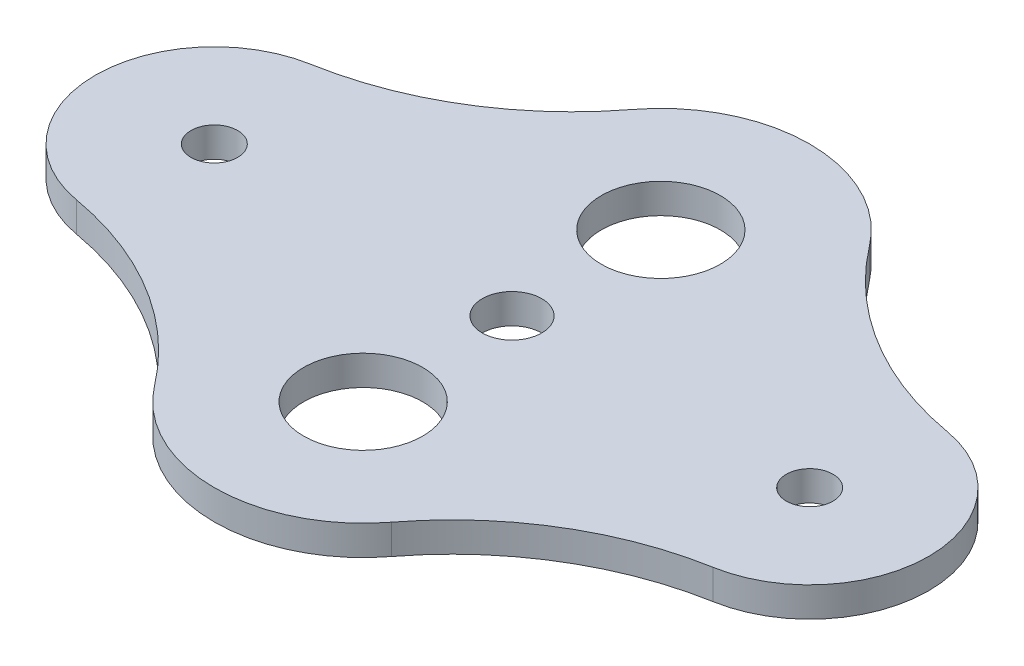
ISO-10303-21;
HEADER;
FILE_DESCRIPTION(('STEP AP214'),'2;1');
FILE_NAME('part.step','',(''),(''),'','','');
FILE_SCHEMA(('AUTOMOTIVE_DESIGN { 1 0 10303 214 1 1 1 1 }'));
ENDSEC;
DATA;
#1=APPLICATION_CONTEXT('core data for automotive mechanical design processes');
#2=APPLICATION_PROTOCOL_DEFINITION('international standard','automotive_design',2000,#1);
#3=PRODUCT_CONTEXT('',#1,'mechanical');
#4=PRODUCT('Part','Part','',(#3));
#5=PRODUCT_RELATED_PRODUCT_CATEGORY('part','',(#4));
#6=PRODUCT_DEFINITION_FORMATION('','',#4);
#7=PRODUCT_DEFINITION_CONTEXT('part definition',#1,'design');
#8=PRODUCT_DEFINITION('design','',#6,#7);
#9=PRODUCT_DEFINITION_SHAPE('','',#8);
#10=(LENGTH_UNIT() NAMED_UNIT(*) SI_UNIT(.MILLI.,.METRE.));
#11=(NAMED_UNIT(*) PLANE_ANGLE_UNIT() SI_UNIT($,.RADIAN.));
#12=(NAMED_UNIT(*) SI_UNIT($,.STERADIAN.) SOLID_ANGLE_UNIT());
#13=UNCERTAINTY_MEASURE_WITH_UNIT(LENGTH_MEASURE(1.E-05),#10,'distance_accuracy_value','');
#14=(GEOMETRIC_REPRESENTATION_CONTEXT(3) GLOBAL_UNCERTAINTY_ASSIGNED_CONTEXT((#13)) GLOBAL_UNIT_ASSIGNED_CONTEXT((#10,
#11,#12)) REPRESENTATION_CONTEXT('',''));
#15=CARTESIAN_POINT('',(0.,0.,0.));
#16=DIRECTION('',(0.,0.,1.));
#17=DIRECTION('',(1.,0.,0.));
#18=AXIS2_PLACEMENT_3D('',#15,#16,#17);
#19=CARTESIAN_POINT('',(-39.9026793061483,3.175,46.2773586122966));
#20=DIRECTION('',(0.,-1.,0.));
#21=DIRECTION('',(0.,0.,-1.));
#22=AXIS2_PLACEMENT_3D('',#19,#20,#21);
#23=CYLINDRICAL_SURFACE('',#22,34.29);
#24=CARTESIAN_POINT('',(-39.9026793061483,0.,46.2773586122966));
#25=DIRECTION('',(0.,-1.,0.));
#26=DIRECTION('',(0.,0.,-1.));
#27=AXIS2_PLACEMENT_3D('',#24,#25,#26);
#28=CIRCLE('',#27,34.29);
#29=CARTESIAN_POINT('',(-33.9534268394995,0.,12.5073942195396));
#30=VERTEX_POINT('',#29);
#31=CARTESIAN_POINT('',(-12.6274301601735,0.,25.4959995608534));
#32=VERTEX_POINT('',#31);
#33=EDGE_CURVE('E129',#30,#32,#28,.T.);
#34=ORIENTED_EDGE('',*,*,#33,.T.);
#35=DIRECTION('',(0.,-1.,0.));
#36=VECTOR('',#35,1.);
#37=CARTESIAN_POINT('',(-12.6274301601735,3.175,25.4959995608534));
#38=LINE('',#37,#36);
#39=CARTESIAN_POINT('',(-12.6274301601735,3.175,25.4959995608534));
#40=VERTEX_POINT('',#39);
#41=EDGE_CURVE('E11',#40,#32,#38,.T.);
#42=ORIENTED_EDGE('',*,*,#41,.F.);
#43=CARTESIAN_POINT('',(-39.9026793061483,3.175,46.2773586122966));
#44=DIRECTION('',(0.,-1.,0.));
#45=DIRECTION('',(0.,0.,-1.));
#46=AXIS2_PLACEMENT_3D('',#43,#44,#45);
#47=CIRCLE('',#46,34.29);
#48=CARTESIAN_POINT('',(-33.9534268394995,3.175,12.5073942195396));
#49=VERTEX_POINT('',#48);
#50=EDGE_CURVE('E144',#49,#40,#47,.T.);
#51=ORIENTED_EDGE('',*,*,#50,.F.);
#52=DIRECTION('',(0.,-1.,0.));
#53=VECTOR('',#52,1.);
#54=CARTESIAN_POINT('',(-33.9534268394995,3.175,12.5073942195396));
#55=LINE('',#54,#53);
#56=EDGE_CURVE('E125',#49,#30,#55,.T.);
#57=ORIENTED_EDGE('',*,*,#56,.T.);
#58=EDGE_LOOP('',(#34,#42,#51,#57));
#59=FACE_BOUND('',#58,.T.);
#60=ADVANCED_FACE('F33',(#59),#23,.F.);
#61=CARTESIAN_POINT('',(0.,3.175,15.875));
#62=DIRECTION('',(0.,-1.,0.));
#63=DIRECTION('',(0.,0.,-1.));
#64=AXIS2_PLACEMENT_3D('',#61,#62,#63);
#65=CYLINDRICAL_SURFACE('',#64,15.875);
#66=CARTESIAN_POINT('',(0.,0.,15.875));
#67=DIRECTION('',(0.,1.,0.));
#68=DIRECTION('',(0.,0.,1.));
#69=AXIS2_PLACEMENT_3D('',#66,#67,#68);
#70=CIRCLE('',#69,15.875);
#71=CARTESIAN_POINT('',(12.6274301601735,0.,25.4959995608534));
#72=VERTEX_POINT('',#71);
#73=EDGE_CURVE('E132',#32,#72,#70,.T.);
#74=ORIENTED_EDGE('',*,*,#73,.T.);
#75=DIRECTION('',(0.,-1.,0.));
#76=VECTOR('',#75,1.);
#77=CARTESIAN_POINT('',(12.6274301601735,3.175,25.4959995608534));
#78=LINE('',#77,#76);
#79=CARTESIAN_POINT('',(12.6274301601735,3.175,25.4959995608534));
#80=VERTEX_POINT('',#79);
#81=EDGE_CURVE('E41',#80,#72,#78,.T.);
#82=ORIENTED_EDGE('',*,*,#81,.F.);
#83=CARTESIAN_POINT('',(0.,3.175,15.875));
#84=DIRECTION('',(0.,1.,0.));
#85=DIRECTION('',(0.,0.,1.));
#86=AXIS2_PLACEMENT_3D('',#83,#84,#85);
#87=CIRCLE('',#86,15.875);
#88=EDGE_CURVE('E92',#40,#80,#87,.T.);
#89=ORIENTED_EDGE('',*,*,#88,.F.);
#90=ORIENTED_EDGE('',*,*,#41,.T.);
#91=EDGE_LOOP('',(#74,#82,#89,#90));
#92=FACE_BOUND('',#91,.T.);
#93=ADVANCED_FACE('F243',(#92),#65,.T.);
#94=CARTESIAN_POINT('',(39.9026793061483,3.175,46.2773586122966));
#95=DIRECTION('',(0.,-1.,0.));
#96=DIRECTION('',(0.,0.,-1.));
#97=AXIS2_PLACEMENT_3D('',#94,#95,#96);
#98=CYLINDRICAL_SURFACE('',#97,34.29);
#99=CARTESIAN_POINT('',(39.9026793061483,0.,46.2773586122966));
#100=DIRECTION('',(0.,-1.,0.));
#101=DIRECTION('',(0.,0.,-1.));
#102=AXIS2_PLACEMENT_3D('',#99,#100,#101);
#103=CIRCLE('',#102,34.29);
#104=CARTESIAN_POINT('',(33.9534268394995,0.,12.5073942195396));
#105=VERTEX_POINT('',#104);
#106=EDGE_CURVE('E135',#72,#105,#103,.T.);
#107=ORIENTED_EDGE('',*,*,#106,.T.);
#108=DIRECTION('',(0.,-1.,0.));
#109=VECTOR('',#108,1.);
#110=CARTESIAN_POINT('',(33.9534268394995,3.175,12.5073942195396));
#111=LINE('',#110,#109);
#112=CARTESIAN_POINT('',(33.9534268394995,3.175,12.5073942195396));
#113=VERTEX_POINT('',#112);
#114=EDGE_CURVE('E151',#113,#105,#111,.T.);
#115=ORIENTED_EDGE('',*,*,#114,.F.);
#116=CARTESIAN_POINT('',(39.9026793061483,3.175,46.2773586122966));
#117=DIRECTION('',(0.,-1.,0.));
#118=DIRECTION('',(0.,0.,-1.));
#119=AXIS2_PLACEMENT_3D('',#116,#117,#118);
#120=CIRCLE('',#119,34.29);
#121=EDGE_CURVE('E159',#80,#113,#120,.T.);
#122=ORIENTED_EDGE('',*,*,#121,.F.);
#123=ORIENTED_EDGE('',*,*,#81,.T.);
#124=EDGE_LOOP('',(#107,#115,#122,#123));
#125=FACE_BOUND('',#124,.T.);
#126=ADVANCED_FACE('F157',(#125),#98,.F.);
#127=CARTESIAN_POINT('',(31.75,3.175,0.));
#128=DIRECTION('',(0.,-1.,0.));
#129=DIRECTION('',(0.,0.,-1.));
#130=AXIS2_PLACEMENT_3D('',#127,#128,#129);
#131=CYLINDRICAL_SURFACE('',#130,12.7);
#132=CARTESIAN_POINT('',(31.75,0.,0.));
#133=DIRECTION('',(0.,1.,0.));
#134=DIRECTION('',(0.,0.,1.));
#135=AXIS2_PLACEMENT_3D('',#132,#133,#134);
#136=CIRCLE('',#135,12.7);
#137=CARTESIAN_POINT('',(33.9534268394995,0.,-12.5073942195396));
#138=VERTEX_POINT('',#137);
#139=EDGE_CURVE('E137',#105,#138,#136,.T.);
#140=ORIENTED_EDGE('',*,*,#139,.T.);
#141=DIRECTION('',(0.,-1.,0.));
#142=VECTOR('',#141,1.);
#143=CARTESIAN_POINT('',(33.9534268394995,3.175,-12.5073942195396));
#144=LINE('',#143,#142);
#145=CARTESIAN_POINT('',(33.9534268394995,3.175,-12.5073942195396));
#146=VERTEX_POINT('',#145);
#147=EDGE_CURVE('E148',#146,#138,#144,.T.);
#148=ORIENTED_EDGE('',*,*,#147,.F.);
#149=CARTESIAN_POINT('',(31.75,3.175,0.));
#150=DIRECTION('',(0.,1.,0.));
#151=DIRECTION('',(0.,0.,1.));
#152=AXIS2_PLACEMENT_3D('',#149,#150,#151);
#153=CIRCLE('',#152,12.7);
#154=EDGE_CURVE('E171',#113,#146,#153,.T.);
#155=ORIENTED_EDGE('',*,*,#154,.F.);
#156=ORIENTED_EDGE('',*,*,#114,.T.);
#157=EDGE_LOOP('',(#140,#148,#155,#156));
#158=FACE_BOUND('',#157,.T.);
#159=ADVANCED_FACE('F167',(#158),#131,.T.);
#160=CARTESIAN_POINT('',(39.9026793061483,3.175,-46.2773586122966));
#161=DIRECTION('',(0.,-1.,0.));
#162=DIRECTION('',(0.,0.,-1.));
#163=AXIS2_PLACEMENT_3D('',#160,#161,#162);
#164=CYLINDRICAL_SURFACE('',#163,34.29);
#165=CARTESIAN_POINT('',(39.9026793061483,0.,-46.2773586122966));
#166=DIRECTION('',(0.,-1.,0.));
#167=DIRECTION('',(0.,0.,1.));
#168=AXIS2_PLACEMENT_3D('',#165,#166,#167);
#169=CIRCLE('',#168,34.29);
#170=CARTESIAN_POINT('',(12.6274301601735,0.,-25.4959995608534));
#171=VERTEX_POINT('',#170);
#172=EDGE_CURVE('E139',#138,#171,#169,.T.);
#173=ORIENTED_EDGE('',*,*,#172,.T.);
#174=DIRECTION('',(0.,-1.,0.));
#175=VECTOR('',#174,1.);
#176=CARTESIAN_POINT('',(12.6274301601735,3.175,-25.4959995608534));
#177=LINE('',#176,#175);
#178=CARTESIAN_POINT('',(12.6274301601735,3.175,-25.4959995608534));
#179=VERTEX_POINT('',#178);
#180=EDGE_CURVE('E120',#179,#171,#177,.T.);
#181=ORIENTED_EDGE('',*,*,#180,.F.);
#182=CARTESIAN_POINT('',(39.9026793061483,3.175,-46.2773586122966));
#183=DIRECTION('',(0.,-1.,0.));
#184=DIRECTION('',(0.,0.,1.));
#185=AXIS2_PLACEMENT_3D('',#182,#183,#184);
#186=CIRCLE('',#185,34.29);
#187=EDGE_CURVE('E111',#146,#179,#186,.T.);
#188=ORIENTED_EDGE('',*,*,#187,.F.);
#189=ORIENTED_EDGE('',*,*,#147,.T.);
#190=EDGE_LOOP('',(#173,#181,#188,#189));
#191=FACE_BOUND('',#190,.T.);
#192=ADVANCED_FACE('F170',(#191),#164,.F.);
#193=CARTESIAN_POINT('',(0.,3.175,-15.875));
#194=DIRECTION('',(0.,-1.,0.));
#195=DIRECTION('',(0.,0.,-1.));
#196=AXIS2_PLACEMENT_3D('',#193,#194,#195);
#197=CYLINDRICAL_SURFACE('',#196,15.875);
#198=CARTESIAN_POINT('',(0.,0.,-15.875));
#199=DIRECTION('',(0.,1.,0.));
#200=DIRECTION('',(0.,0.,1.));
#201=AXIS2_PLACEMENT_3D('',#198,#199,#200);
#202=CIRCLE('',#201,15.875);
#203=CARTESIAN_POINT('',(-12.6274301601735,0.,-25.4959995608533));
#204=VERTEX_POINT('',#203);
#205=EDGE_CURVE('E119',#171,#204,#202,.T.);
#206=ORIENTED_EDGE('',*,*,#205,.T.);
#207=DIRECTION('',(0.,-1.,0.));
#208=VECTOR('',#207,1.);
#209=CARTESIAN_POINT('',(-12.6274301601735,3.175,-25.4959995608533));
#210=LINE('',#209,#208);
#211=CARTESIAN_POINT('',(-12.6274301601735,3.175,-25.4959995608533));
#212=VERTEX_POINT('',#211);
#213=EDGE_CURVE('E116',#212,#204,#210,.T.);
#214=ORIENTED_EDGE('',*,*,#213,.F.);
#215=CARTESIAN_POINT('',(0.,3.175,-15.875));
#216=DIRECTION('',(0.,1.,0.));
#217=DIRECTION('',(0.,0.,1.));
#218=AXIS2_PLACEMENT_3D('',#215,#216,#217);
#219=CIRCLE('',#218,15.875);
#220=EDGE_CURVE('E105',#179,#212,#219,.T.);
#221=ORIENTED_EDGE('',*,*,#220,.F.);
#222=ORIENTED_EDGE('',*,*,#180,.T.);
#223=EDGE_LOOP('',(#206,#214,#221,#222));
#224=FACE_BOUND('',#223,.T.);
#225=ADVANCED_FACE('F117',(#224),#197,.T.);
#226=CARTESIAN_POINT('',(-39.9026793061483,3.175,-46.2773586122966));
#227=DIRECTION('',(0.,-1.,0.));
#228=DIRECTION('',(0.,0.,-1.));
#229=AXIS2_PLACEMENT_3D('',#226,#227,#228);
#230=CYLINDRICAL_SURFACE('',#229,34.29);
#231=CARTESIAN_POINT('',(-39.9026793061483,0.,-46.2773586122966));
#232=DIRECTION('',(0.,-1.,0.));
#233=DIRECTION('',(0.,0.,-1.));
#234=AXIS2_PLACEMENT_3D('',#231,#232,#233);
#235=CIRCLE('',#234,34.29);
#236=CARTESIAN_POINT('',(-33.9534268394995,0.,-12.5073942195396));
#237=VERTEX_POINT('',#236);
#238=EDGE_CURVE('E78',#204,#237,#235,.T.);
#239=ORIENTED_EDGE('',*,*,#238,.T.);
#240=DIRECTION('',(0.,-1.,0.));
#241=VECTOR('',#240,1.);
#242=CARTESIAN_POINT('',(-33.9534268394995,3.175,-12.5073942195396));
#243=LINE('',#242,#241);
#244=CARTESIAN_POINT('',(-33.9534268394995,3.175,-12.5073942195396));
#245=VERTEX_POINT('',#244);
#246=EDGE_CURVE('E121',#245,#237,#243,.T.);
#247=ORIENTED_EDGE('',*,*,#246,.F.);
#248=CARTESIAN_POINT('',(-39.9026793061483,3.175,-46.2773586122966));
#249=DIRECTION('',(0.,-1.,0.));
#250=DIRECTION('',(0.,0.,-1.));
#251=AXIS2_PLACEMENT_3D('',#248,#249,#250);
#252=CIRCLE('',#251,34.29);
#253=EDGE_CURVE('E109',#212,#245,#252,.T.);
#254=ORIENTED_EDGE('',*,*,#253,.F.);
#255=ORIENTED_EDGE('',*,*,#213,.T.);
#256=EDGE_LOOP('',(#239,#247,#254,#255));
#257=FACE_BOUND('',#256,.T.);
#258=ADVANCED_FACE('F123',(#257),#230,.F.);
#259=CARTESIAN_POINT('',(-31.75,3.175,0.));
#260=DIRECTION('',(0.,-1.,0.));
#261=DIRECTION('',(0.,0.,-1.));
#262=AXIS2_PLACEMENT_3D('',#259,#260,#261);
#263=CYLINDRICAL_SURFACE('',#262,12.7);
#264=CARTESIAN_POINT('',(-31.75,0.,0.));
#265=DIRECTION('',(0.,1.,0.));
#266=DIRECTION('',(0.,0.,1.));
#267=AXIS2_PLACEMENT_3D('',#264,#265,#266);
#268=CIRCLE('',#267,12.7);
#269=EDGE_CURVE('E84',#237,#30,#268,.T.);
#270=ORIENTED_EDGE('',*,*,#269,.T.);
#271=ORIENTED_EDGE('',*,*,#56,.F.);
#272=CARTESIAN_POINT('',(-31.75,3.175,0.));
#273=DIRECTION('',(0.,1.,0.));
#274=DIRECTION('',(0.,0.,1.));
#275=AXIS2_PLACEMENT_3D('',#272,#273,#274);
#276=CIRCLE('',#275,12.7);
#277=EDGE_CURVE('E49',#245,#49,#276,.T.);
#278=ORIENTED_EDGE('',*,*,#277,.F.);
#279=ORIENTED_EDGE('',*,*,#246,.T.);
#280=EDGE_LOOP('',(#270,#271,#278,#279));
#281=FACE_BOUND('',#280,.T.);
#282=ADVANCED_FACE('F218',(#281),#263,.T.);
#283=CARTESIAN_POINT('',(-19.9513396530742,3.175,31.0761793061483));
#284=DIRECTION('',(0.,-1.,0.));
#285=DIRECTION('',(0.,0.,-1.));
#286=AXIS2_PLACEMENT_3D('',#283,#284,#285);
#287=PLANE('',#286);
#288=CARTESIAN_POINT('',(-31.75,3.175,0.));
#289=DIRECTION('',(0.,1.,0.));
#290=DIRECTION('',(0.,0.,1.));
#291=AXIS2_PLACEMENT_3D('',#288,#289,#290);
#292=CIRCLE('',#291,2.4892);
#293=CARTESIAN_POINT('',(-31.75,3.175,2.4892));
#294=VERTEX_POINT('',#293);
#295=EDGE_CURVE('E201',#294,#294,#292,.T.);
#296=ORIENTED_EDGE('',*,*,#295,.F.);
#297=EDGE_LOOP('',(#296));
#298=FACE_BOUND('',#297,.T.);
#299=CARTESIAN_POINT('',(31.75,3.175,0.));
#300=DIRECTION('',(0.,1.,0.));
#301=DIRECTION('',(0.,0.,1.));
#302=AXIS2_PLACEMENT_3D('',#299,#300,#301);
#303=CIRCLE('',#302,2.4892);
#304=CARTESIAN_POINT('',(31.75,3.175,2.4892));
#305=VERTEX_POINT('',#304);
#306=EDGE_CURVE('E195',#305,#305,#303,.T.);
#307=ORIENTED_EDGE('',*,*,#306,.F.);
#308=EDGE_LOOP('',(#307));
#309=FACE_BOUND('',#308,.T.);
#310=CARTESIAN_POINT('',(0.,3.175,-15.875));
#311=DIRECTION('',(0.,1.,0.));
#312=DIRECTION('',(0.,0.,1.));
#313=AXIS2_PLACEMENT_3D('',#310,#311,#312);
#314=CIRCLE('',#313,6.35);
#315=CARTESIAN_POINT('',(0.,3.175,-9.525));
#316=VERTEX_POINT('',#315);
#317=EDGE_CURVE('E190',#316,#316,#314,.T.);
#318=ORIENTED_EDGE('',*,*,#317,.F.);
#319=EDGE_LOOP('',(#318));
#320=FACE_BOUND('',#319,.T.);
#321=CARTESIAN_POINT('',(0.,3.175,15.875));
#322=DIRECTION('',(0.,1.,0.));
#323=DIRECTION('',(0.,0.,1.));
#324=AXIS2_PLACEMENT_3D('',#321,#322,#323);
#325=CIRCLE('',#324,6.35);
#326=CARTESIAN_POINT('',(0.,3.175,22.225));
#327=VERTEX_POINT('',#326);
#328=EDGE_CURVE('E183',#327,#327,#325,.T.);
#329=ORIENTED_EDGE('',*,*,#328,.F.);
#330=EDGE_LOOP('',(#329));
#331=FACE_BOUND('',#330,.T.);
#332=CARTESIAN_POINT('',(0.,3.175,0.));
#333=DIRECTION('',(0.,1.,0.));
#334=DIRECTION('',(0.,0.,1.));
#335=AXIS2_PLACEMENT_3D('',#332,#333,#334);
#336=CIRCLE('',#335,3.175);
#337=CARTESIAN_POINT('',(0.,3.175,3.175));
#338=VERTEX_POINT('',#337);
#339=EDGE_CURVE('E179',#338,#338,#336,.T.);
#340=ORIENTED_EDGE('',*,*,#339,.F.);
#341=EDGE_LOOP('',(#340));
#342=FACE_BOUND('',#341,.T.);
#343=ORIENTED_EDGE('',*,*,#50,.T.);
#344=ORIENTED_EDGE('',*,*,#88,.T.);
#345=ORIENTED_EDGE('',*,*,#121,.T.);
#346=ORIENTED_EDGE('',*,*,#154,.T.);
#347=ORIENTED_EDGE('',*,*,#187,.T.);
#348=ORIENTED_EDGE('',*,*,#220,.T.);
#349=ORIENTED_EDGE('',*,*,#253,.T.);
#350=ORIENTED_EDGE('',*,*,#277,.T.);
#351=EDGE_LOOP('',(#343,#344,#345,#346,#347,#348,#349,#350));
#352=FACE_BOUND('',#351,.T.);
#353=ADVANCED_FACE('F107',(#298,#309,#320,#331,#342,#352),#287,.F.);
#354=CARTESIAN_POINT('',(-19.9513396530742,0.,31.0761793061483));
#355=DIRECTION('',(0.,-1.,0.));
#356=DIRECTION('',(0.,0.,-1.));
#357=AXIS2_PLACEMENT_3D('',#354,#355,#356);
#358=PLANE('',#357);
#359=CARTESIAN_POINT('',(-31.75,0.,0.));
#360=DIRECTION('',(0.,1.,0.));
#361=DIRECTION('',(0.,0.,1.));
#362=AXIS2_PLACEMENT_3D('',#359,#360,#361);
#363=CIRCLE('',#362,2.4892);
#364=CARTESIAN_POINT('',(-31.75,0.,2.4892));
#365=VERTEX_POINT('',#364);
#366=EDGE_CURVE('E187',#365,#365,#363,.T.);
#367=ORIENTED_EDGE('',*,*,#366,.T.);
#368=EDGE_LOOP('',(#367));
#369=FACE_BOUND('',#368,.T.);
#370=CARTESIAN_POINT('',(31.75,0.,0.));
#371=DIRECTION('',(0.,1.,0.));
#372=DIRECTION('',(0.,0.,1.));
#373=AXIS2_PLACEMENT_3D('',#370,#371,#372);
#374=CIRCLE('',#373,2.4892);
#375=CARTESIAN_POINT('',(31.75,0.,2.4892));
#376=VERTEX_POINT('',#375);
#377=EDGE_CURVE('E198',#376,#376,#374,.T.);
#378=ORIENTED_EDGE('',*,*,#377,.T.);
#379=EDGE_LOOP('',(#378));
#380=FACE_BOUND('',#379,.T.);
#381=CARTESIAN_POINT('',(0.,0.,-15.875));
#382=DIRECTION('',(0.,1.,0.));
#383=DIRECTION('',(0.,0.,1.));
#384=AXIS2_PLACEMENT_3D('',#381,#382,#383);
#385=CIRCLE('',#384,6.35);
#386=CARTESIAN_POINT('',(0.,0.,-9.525));
#387=VERTEX_POINT('',#386);
#388=EDGE_CURVE('E182',#387,#387,#385,.T.);
#389=ORIENTED_EDGE('',*,*,#388,.T.);
#390=EDGE_LOOP('',(#389));
#391=FACE_BOUND('',#390,.T.);
#392=CARTESIAN_POINT('',(0.,0.,15.875));
#393=DIRECTION('',(0.,1.,0.));
#394=DIRECTION('',(0.,0.,1.));
#395=AXIS2_PLACEMENT_3D('',#392,#393,#394);
#396=CIRCLE('',#395,6.35);
#397=CARTESIAN_POINT('',(0.,0.,22.225));
#398=VERTEX_POINT('',#397);
#399=EDGE_CURVE('E186',#398,#398,#396,.T.);
#400=ORIENTED_EDGE('',*,*,#399,.T.);
#401=EDGE_LOOP('',(#400));
#402=FACE_BOUND('',#401,.T.);
#403=CARTESIAN_POINT('',(0.,0.,0.));
#404=DIRECTION('',(0.,1.,0.));
#405=DIRECTION('',(0.,0.,1.));
#406=AXIS2_PLACEMENT_3D('',#403,#404,#405);
#407=CIRCLE('',#406,3.175);
#408=CARTESIAN_POINT('',(0.,0.,3.175));
#409=VERTEX_POINT('',#408);
#410=EDGE_CURVE('E133',#409,#409,#407,.T.);
#411=ORIENTED_EDGE('',*,*,#410,.T.);
#412=EDGE_LOOP('',(#411));
#413=FACE_BOUND('',#412,.T.);
#414=ORIENTED_EDGE('',*,*,#33,.F.);
#415=ORIENTED_EDGE('',*,*,#269,.F.);
#416=ORIENTED_EDGE('',*,*,#238,.F.);
#417=ORIENTED_EDGE('',*,*,#205,.F.);
#418=ORIENTED_EDGE('',*,*,#172,.F.);
#419=ORIENTED_EDGE('',*,*,#139,.F.);
#420=ORIENTED_EDGE('',*,*,#106,.F.);
#421=ORIENTED_EDGE('',*,*,#73,.F.);
#422=EDGE_LOOP('',(#414,#415,#416,#417,#418,#419,#420,#421));
#423=FACE_BOUND('',#422,.T.);
#424=ADVANCED_FACE('F163',(#369,#380,#391,#402,#413,#423),#358,.T.);
#425=CARTESIAN_POINT('',(0.,3.175,0.));
#426=DIRECTION('',(0.,1.,0.));
#427=DIRECTION('',(0.,0.,1.));
#428=AXIS2_PLACEMENT_3D('',#425,#426,#427);
#429=CYLINDRICAL_SURFACE('',#428,3.175);
#430=ORIENTED_EDGE('',*,*,#410,.F.);
#431=EDGE_LOOP('',(#430));
#432=FACE_BOUND('',#431,.T.);
#433=ORIENTED_EDGE('',*,*,#339,.T.);
#434=EDGE_LOOP('',(#433));
#435=FACE_BOUND('',#434,.T.);
#436=ADVANCED_FACE('F228',(#432,#435),#429,.F.);
#437=CARTESIAN_POINT('',(0.,0.,15.875));
#438=DIRECTION('',(0.,1.,0.));
#439=DIRECTION('',(0.,0.,1.));
#440=AXIS2_PLACEMENT_3D('',#437,#438,#439);
#441=CYLINDRICAL_SURFACE('',#440,6.35);
#442=ORIENTED_EDGE('',*,*,#399,.F.);
#443=EDGE_LOOP('',(#442));
#444=FACE_BOUND('',#443,.T.);
#445=ORIENTED_EDGE('',*,*,#328,.T.);
#446=EDGE_LOOP('',(#445));
#447=FACE_BOUND('',#446,.T.);
#448=ADVANCED_FACE('F230',(#444,#447),#441,.F.);
#449=CARTESIAN_POINT('',(0.,0.,-15.875));
#450=DIRECTION('',(0.,1.,0.));
#451=DIRECTION('',(0.,0.,1.));
#452=AXIS2_PLACEMENT_3D('',#449,#450,#451);
#453=CYLINDRICAL_SURFACE('',#452,6.35);
#454=ORIENTED_EDGE('',*,*,#388,.F.);
#455=EDGE_LOOP('',(#454));
#456=FACE_BOUND('',#455,.T.);
#457=ORIENTED_EDGE('',*,*,#317,.T.);
#458=EDGE_LOOP('',(#457));
#459=FACE_BOUND('',#458,.T.);
#460=ADVANCED_FACE('F237',(#456,#459),#453,.F.);
#461=CARTESIAN_POINT('',(31.75,0.,0.));
#462=DIRECTION('',(0.,1.,0.));
#463=DIRECTION('',(0.,0.,1.));
#464=AXIS2_PLACEMENT_3D('',#461,#462,#463);
#465=CYLINDRICAL_SURFACE('',#464,2.4892);
#466=ORIENTED_EDGE('',*,*,#377,.F.);
#467=EDGE_LOOP('',(#466));
#468=FACE_BOUND('',#467,.T.);
#469=ORIENTED_EDGE('',*,*,#306,.T.);
#470=EDGE_LOOP('',(#469));
#471=FACE_BOUND('',#470,.T.);
#472=ADVANCED_FACE('F212',(#468,#471),#465,.F.);
#473=CARTESIAN_POINT('',(-31.75,0.,0.));
#474=DIRECTION('',(0.,1.,0.));
#475=DIRECTION('',(0.,0.,1.));
#476=AXIS2_PLACEMENT_3D('',#473,#474,#475);
#477=CYLINDRICAL_SURFACE('',#476,2.4892);
#478=ORIENTED_EDGE('',*,*,#366,.F.);
#479=EDGE_LOOP('',(#478));
#480=FACE_BOUND('',#479,.T.);
#481=ORIENTED_EDGE('',*,*,#295,.T.);
#482=EDGE_LOOP('',(#481));
#483=FACE_BOUND('',#482,.T.);
#484=ADVANCED_FACE('F209',(#480,#483),#477,.F.);
#485=CLOSED_SHELL('',(#60,#93,#126,#159,#192,#225,#258,#282,#353,#424,#436,#448,#460,#472,#484));
#486=MANIFOLD_SOLID_BREP('B2',#485);
#487=ADVANCED_BREP_SHAPE_REPRESENTATION('',(#18,#486),#14);
#488=SHAPE_DEFINITION_REPRESENTATION(#9,#487);
ENDSEC;
END-ISO-10303-21;
